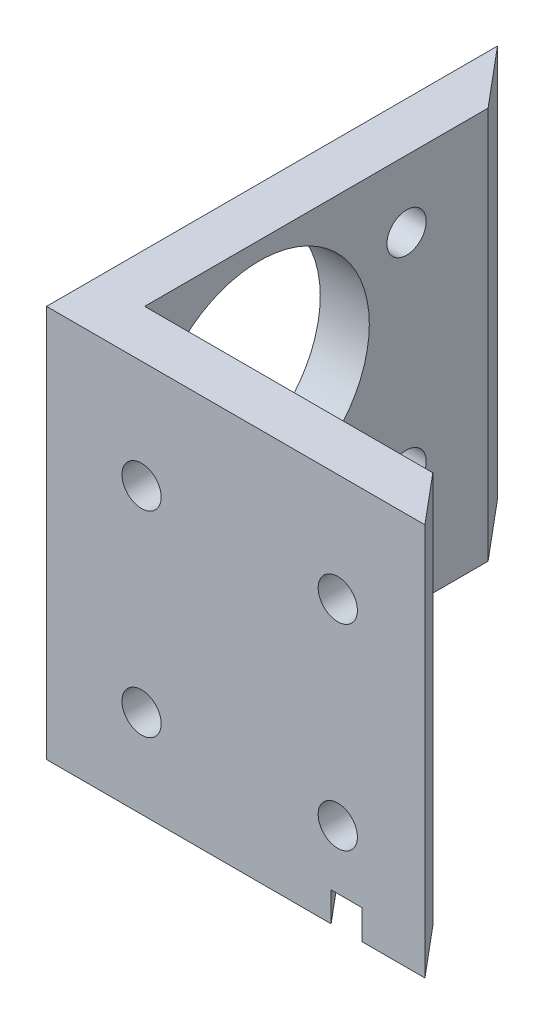
ISO-10303-21;
HEADER;
FILE_DESCRIPTION(('STEP AP214'),'2;1');
FILE_NAME('part.step','',(''),(''),'','','');
FILE_SCHEMA(('AUTOMOTIVE_DESIGN { 1 0 10303 214 1 1 1 1 }'));
ENDSEC;
DATA;
#1=APPLICATION_CONTEXT('core data for automotive mechanical design processes');
#2=APPLICATION_PROTOCOL_DEFINITION('international standard','automotive_design',2000,#1);
#3=PRODUCT_CONTEXT('',#1,'mechanical');
#4=PRODUCT('Part','Part','',(#3));
#5=PRODUCT_RELATED_PRODUCT_CATEGORY('part','',(#4));
#6=PRODUCT_DEFINITION_FORMATION('','',#4);
#7=PRODUCT_DEFINITION_CONTEXT('part definition',#1,'design');
#8=PRODUCT_DEFINITION('design','',#6,#7);
#9=PRODUCT_DEFINITION_SHAPE('','',#8);
#10=(LENGTH_UNIT() NAMED_UNIT(*) SI_UNIT(.MILLI.,.METRE.));
#11=(NAMED_UNIT(*) PLANE_ANGLE_UNIT() SI_UNIT($,.RADIAN.));
#12=(NAMED_UNIT(*) SI_UNIT($,.STERADIAN.) SOLID_ANGLE_UNIT());
#13=UNCERTAINTY_MEASURE_WITH_UNIT(LENGTH_MEASURE(1.E-05),#10,'distance_accuracy_value','');
#14=(GEOMETRIC_REPRESENTATION_CONTEXT(3) GLOBAL_UNCERTAINTY_ASSIGNED_CONTEXT((#13)) GLOBAL_UNIT_ASSIGNED_CONTEXT((#10,
#11,#12)) REPRESENTATION_CONTEXT('',''));
#15=CARTESIAN_POINT('',(0.,0.,0.));
#16=DIRECTION('',(0.,0.,1.));
#17=DIRECTION('',(1.,0.,0.));
#18=AXIS2_PLACEMENT_3D('',#15,#16,#17);
#19=CARTESIAN_POINT('',(0.,0.,0.));
#20=DIRECTION('',(0.,-1.,0.));
#21=DIRECTION('',(0.,0.,-1.));
#22=AXIS2_PLACEMENT_3D('',#19,#20,#21);
#23=PLANE('',#22);
#24=DIRECTION('',(-0.642787609686534,0.,-0.766044443118982));
#25=VECTOR('',#24,1.);
#26=CARTESIAN_POINT('',(36.8381317972101,0.,0.));
#27=LINE('',#26,#25);
#28=CARTESIAN_POINT('',(36.8381317972101,0.,0.));
#29=VERTEX_POINT('',#28);
#30=CARTESIAN_POINT('',(31.5098491392345,0.,-6.35000000000001));
#31=VERTEX_POINT('',#30);
#32=EDGE_CURVE('E150',#29,#31,#27,.T.);
#33=ORIENTED_EDGE('',*,*,#32,.F.);
#34=DIRECTION('',(1.,0.,0.));
#35=VECTOR('',#34,1.);
#36=CARTESIAN_POINT('',(0.,0.,0.));
#37=LINE('',#36,#35);
#38=CARTESIAN_POINT('',(0.,0.,0.));
#39=VERTEX_POINT('',#38);
#40=EDGE_CURVE('E247',#39,#29,#37,.T.);
#41=ORIENTED_EDGE('',*,*,#40,.F.);
#42=DIRECTION('',(0.,0.,1.));
#43=VECTOR('',#42,1.);
#44=CARTESIAN_POINT('',(0.,0.,-58.3725865656664));
#45=LINE('',#44,#43);
#46=CARTESIAN_POINT('',(0.,0.,-43.9019759137848));
#47=VERTEX_POINT('',#46);
#48=EDGE_CURVE('E244',#47,#39,#45,.T.);
#49=ORIENTED_EDGE('',*,*,#48,.F.);
#50=DIRECTION('',(-0.642787609686534,0.,-0.766044443118983));
#51=VECTOR('',#50,1.);
#52=CARTESIAN_POINT('',(21.6175031262252,0.,-18.139238900189));
#53=LINE('',#52,#51);
#54=CARTESIAN_POINT('',(6.34999999999999,0.,-36.3343406008115));
#55=VERTEX_POINT('',#54);
#56=EDGE_CURVE('E41',#55,#47,#53,.T.);
#57=ORIENTED_EDGE('',*,*,#56,.F.);
#58=DIRECTION('',(0.,0.,-1.));
#59=VECTOR('',#58,1.);
#60=CARTESIAN_POINT('',(6.35,0.,-50.8049512526931));
#61=LINE('',#60,#59);
#62=CARTESIAN_POINT('',(6.35000000000001,0.,-6.35));
#63=VERTEX_POINT('',#62);
#64=EDGE_CURVE('E231',#63,#55,#61,.T.);
#65=ORIENTED_EDGE('',*,*,#64,.F.);
#66=DIRECTION('',(-1.,0.,0.));
#67=VECTOR('',#66,1.);
#68=CARTESIAN_POINT('',(6.35000000000001,0.,-6.35));
#69=LINE('',#68,#67);
#70=EDGE_CURVE('E252',#31,#63,#69,.T.);
#71=ORIENTED_EDGE('',*,*,#70,.F.);
#72=EDGE_LOOP('',(#33,#41,#49,#57,#65,#71));
#73=FACE_BOUND('',#72,.T.);
#74=ADVANCED_FACE('F33',(#73),#23,.T.);
#75=DIRECTION('',(0.642787609686534,0.,0.766044443118982));
#76=VECTOR('',#75,1.);
#77=CARTESIAN_POINT('',(0.,0.,-48.6438221380554));
#78=LINE('',#77,#76);
#79=CARTESIAN_POINT('',(0.,0.,-48.6438221380554));
#80=VERTEX_POINT('',#79);
#81=CARTESIAN_POINT('',(6.35000000000001,0.,-41.076186825082));
#82=VERTEX_POINT('',#81);
#83=EDGE_CURVE('E305',#80,#82,#78,.T.);
#84=ORIENTED_EDGE('',*,*,#83,.F.);
#85=CARTESIAN_POINT('',(0.,0.,-58.3725865656664));
#86=VERTEX_POINT('',#85);
#87=EDGE_CURVE('E155',#86,#80,#45,.T.);
#88=ORIENTED_EDGE('',*,*,#87,.F.);
#89=DIRECTION('',(-0.642787609686534,0.,-0.766044443118982));
#90=VECTOR('',#89,1.);
#91=CARTESIAN_POINT('',(6.35,0.,-50.8049512526931));
#92=LINE('',#91,#90);
#93=CARTESIAN_POINT('',(6.35,0.,-50.8049512526931));
#94=VERTEX_POINT('',#93);
#95=EDGE_CURVE('E226',#94,#86,#92,.T.);
#96=ORIENTED_EDGE('',*,*,#95,.F.);
#97=EDGE_CURVE('E256',#82,#94,#61,.T.);
#98=ORIENTED_EDGE('',*,*,#97,.F.);
#99=EDGE_LOOP('',(#84,#88,#96,#98));
#100=FACE_BOUND('',#99,.T.);
#101=ADVANCED_FACE('F304',(#100),#23,.T.);
#102=CARTESIAN_POINT('',(6.35,50.8,-50.8049512526931));
#103=DIRECTION('',(-0.766044443118982,0.,0.642787609686534));
#104=DIRECTION('',(0.642787609686534,0.,0.766044443118982));
#105=AXIS2_PLACEMENT_3D('',#102,#103,#104);
#106=PLANE('',#105);
#107=ORIENTED_EDGE('',*,*,#95,.T.);
#108=DIRECTION('',(0.,-1.,0.));
#109=VECTOR('',#108,1.);
#110=CARTESIAN_POINT('',(0.,50.8,-58.3725865656664));
#111=LINE('',#110,#109);
#112=CARTESIAN_POINT('',(0.,50.8,-58.3725865656664));
#113=VERTEX_POINT('',#112);
#114=EDGE_CURVE('E273',#113,#86,#111,.T.);
#115=ORIENTED_EDGE('',*,*,#114,.F.);
#116=DIRECTION('',(-0.642787609686534,0.,-0.766044443118982));
#117=VECTOR('',#116,1.);
#118=CARTESIAN_POINT('',(6.35,50.8,-50.8049512526931));
#119=LINE('',#118,#117);
#120=CARTESIAN_POINT('',(6.35,50.8,-50.8049512526931));
#121=VERTEX_POINT('',#120);
#122=EDGE_CURVE('E227',#121,#113,#119,.T.);
#123=ORIENTED_EDGE('',*,*,#122,.F.);
#124=DIRECTION('',(0.,-1.,0.));
#125=VECTOR('',#124,1.);
#126=CARTESIAN_POINT('',(6.35,50.8,-50.8049512526931));
#127=LINE('',#126,#125);
#128=EDGE_CURVE('E241',#121,#94,#127,.T.);
#129=ORIENTED_EDGE('',*,*,#128,.T.);
#130=EDGE_LOOP('',(#107,#115,#123,#129));
#131=FACE_BOUND('',#130,.T.);
#132=ADVANCED_FACE('F35',(#131),#106,.F.);
#133=CARTESIAN_POINT('',(0.,50.8,-58.3725865656664));
#134=DIRECTION('',(1.,0.,0.));
#135=DIRECTION('',(0.,0.,-1.));
#136=AXIS2_PLACEMENT_3D('',#133,#134,#135);
#137=PLANE('',#136);
#138=CARTESIAN_POINT('',(0.,42.1259,-40.259));
#139=DIRECTION('',(1.,0.,0.));
#140=DIRECTION('',(0.,0.,-1.));
#141=AXIS2_PLACEMENT_3D('',#138,#139,#140);
#142=CIRCLE('',#141,2.54);
#143=CARTESIAN_POINT('',(0.,42.1259,-42.799));
#144=VERTEX_POINT('',#143);
#145=EDGE_CURVE('E181',#144,#144,#142,.F.);
#146=ORIENTED_EDGE('',*,*,#145,.F.);
#147=EDGE_LOOP('',(#146));
#148=FACE_BOUND('',#147,.T.);
#149=CARTESIAN_POINT('',(0.,15.2019,-40.259));
#150=DIRECTION('',(1.,0.,0.));
#151=DIRECTION('',(0.,0.,-1.));
#152=AXIS2_PLACEMENT_3D('',#149,#150,#151);
#153=CIRCLE('',#152,2.54);
#154=CARTESIAN_POINT('',(0.,15.2019,-42.799));
#155=VERTEX_POINT('',#154);
#156=EDGE_CURVE('E187',#155,#155,#153,.F.);
#157=ORIENTED_EDGE('',*,*,#156,.F.);
#158=EDGE_LOOP('',(#157));
#159=FACE_BOUND('',#158,.T.);
#160=CARTESIAN_POINT('',(0.,15.2019,-13.335));
#161=DIRECTION('',(1.,0.,0.));
#162=DIRECTION('',(0.,0.,-1.));
#163=AXIS2_PLACEMENT_3D('',#160,#161,#162);
#164=CIRCLE('',#163,2.54);
#165=CARTESIAN_POINT('',(0.,15.2019,-15.875));
#166=VERTEX_POINT('',#165);
#167=EDGE_CURVE('E193',#166,#166,#164,.F.);
#168=ORIENTED_EDGE('',*,*,#167,.F.);
#169=EDGE_LOOP('',(#168));
#170=FACE_BOUND('',#169,.T.);
#171=CARTESIAN_POINT('',(0.,34.2519,-21.209));
#172=DIRECTION('',(1.,0.,0.));
#173=DIRECTION('',(0.,0.,-1.));
#174=AXIS2_PLACEMENT_3D('',#171,#172,#173);
#175=CIRCLE('',#174,14.224);
#176=CARTESIAN_POINT('',(0.,34.2519,-35.433));
#177=VERTEX_POINT('',#176);
#178=EDGE_CURVE('E199',#177,#177,#175,.F.);
#179=ORIENTED_EDGE('',*,*,#178,.F.);
#180=EDGE_LOOP('',(#179));
#181=FACE_BOUND('',#180,.T.);
#182=DIRECTION('',(0.,0.,-1.));
#183=VECTOR('',#182,1.);
#184=CARTESIAN_POINT('',(0.,3.81,-43.9019759137848));
#185=LINE('',#184,#183);
#186=CARTESIAN_POINT('',(0.,3.81,-43.9019759137848));
#187=VERTEX_POINT('',#186);
#188=CARTESIAN_POINT('',(0.,3.81,-48.6438221380554));
#189=VERTEX_POINT('',#188);
#190=EDGE_CURVE('E143',#187,#189,#185,.T.);
#191=ORIENTED_EDGE('',*,*,#190,.F.);
#192=DIRECTION('',(0.,-1.,0.));
#193=VECTOR('',#192,1.);
#194=CARTESIAN_POINT('',(0.,3.81,-43.9019759137848));
#195=LINE('',#194,#193);
#196=EDGE_CURVE('E167',#187,#47,#195,.T.);
#197=ORIENTED_EDGE('',*,*,#196,.T.);
#198=ORIENTED_EDGE('',*,*,#48,.T.);
#199=DIRECTION('',(0.,-1.,0.));
#200=VECTOR('',#199,1.);
#201=CARTESIAN_POINT('',(0.,50.8,0.));
#202=LINE('',#201,#200);
#203=CARTESIAN_POINT('',(0.,50.8,0.));
#204=VERTEX_POINT('',#203);
#205=EDGE_CURVE('E270',#204,#39,#202,.T.);
#206=ORIENTED_EDGE('',*,*,#205,.F.);
#207=DIRECTION('',(0.,0.,1.));
#208=VECTOR('',#207,1.);
#209=CARTESIAN_POINT('',(0.,50.8,-58.3725865656664));
#210=LINE('',#209,#208);
#211=EDGE_CURVE('E230',#113,#204,#210,.T.);
#212=ORIENTED_EDGE('',*,*,#211,.F.);
#213=ORIENTED_EDGE('',*,*,#114,.T.);
#214=ORIENTED_EDGE('',*,*,#87,.T.);
#215=DIRECTION('',(0.,-1.,0.));
#216=VECTOR('',#215,1.);
#217=CARTESIAN_POINT('',(0.,3.81,-48.6438221380554));
#218=LINE('',#217,#216);
#219=EDGE_CURVE('E48',#189,#80,#218,.T.);
#220=ORIENTED_EDGE('',*,*,#219,.F.);
#221=EDGE_LOOP('',(#191,#197,#198,#206,#212,#213,#214,#220));
#222=FACE_BOUND('',#221,.T.);
#223=ADVANCED_FACE('F153',(#148,#159,#170,#181,#222),#137,.F.);
#224=CARTESIAN_POINT('',(0.,50.8,0.));
#225=DIRECTION('',(0.,0.,-1.));
#226=DIRECTION('',(-1.,0.,0.));
#227=AXIS2_PLACEMENT_3D('',#224,#225,#226);
#228=PLANE('',#227);
#229=ORIENTED_EDGE('',*,*,#40,.T.);
#230=DIRECTION('',(0.,-1.,0.));
#231=VECTOR('',#230,1.);
#232=CARTESIAN_POINT('',(36.8381317972101,3.81,0.));
#233=LINE('',#232,#231);
#234=CARTESIAN_POINT('',(36.8381317972101,3.81,0.));
#235=VERTEX_POINT('',#234);
#236=EDGE_CURVE('E160',#235,#29,#233,.T.);
#237=ORIENTED_EDGE('',*,*,#236,.F.);
#238=DIRECTION('',(-1.,0.,0.));
#239=VECTOR('',#238,1.);
#240=CARTESIAN_POINT('',(40.8170132150949,3.81,0.));
#241=LINE('',#240,#239);
#242=CARTESIAN_POINT('',(40.8170132150949,3.81,0.));
#243=VERTEX_POINT('',#242);
#244=EDGE_CURVE('E139',#243,#235,#241,.T.);
#245=ORIENTED_EDGE('',*,*,#244,.F.);
#246=DIRECTION('',(0.,-1.,0.));
#247=VECTOR('',#246,1.);
#248=CARTESIAN_POINT('',(40.8170132150949,3.81,0.));
#249=LINE('',#248,#247);
#250=CARTESIAN_POINT('',(40.8170132150949,0.,0.));
#251=VERTEX_POINT('',#250);
#252=EDGE_CURVE('E156',#243,#251,#249,.T.);
#253=ORIENTED_EDGE('',*,*,#252,.T.);
#254=CARTESIAN_POINT('',(48.980415858114,0.,0.));
#255=VERTEX_POINT('',#254);
#256=EDGE_CURVE('E246',#251,#255,#37,.T.);
#257=ORIENTED_EDGE('',*,*,#256,.T.);
#258=DIRECTION('',(0.,-1.,0.));
#259=VECTOR('',#258,1.);
#260=CARTESIAN_POINT('',(48.980415858114,50.8,0.));
#261=LINE('',#260,#259);
#262=CARTESIAN_POINT('',(48.980415858114,50.8,0.));
#263=VERTEX_POINT('',#262);
#264=EDGE_CURVE('E267',#263,#255,#261,.T.);
#265=ORIENTED_EDGE('',*,*,#264,.F.);
#266=DIRECTION('',(1.,0.,0.));
#267=VECTOR('',#266,1.);
#268=CARTESIAN_POINT('',(0.,50.8,0.));
#269=LINE('',#268,#267);
#270=EDGE_CURVE('E233',#204,#263,#269,.T.);
#271=ORIENTED_EDGE('',*,*,#270,.F.);
#272=ORIENTED_EDGE('',*,*,#205,.T.);
#273=EDGE_LOOP('',(#229,#237,#245,#253,#257,#265,#271,#272));
#274=FACE_BOUND('',#273,.T.);
#275=CARTESIAN_POINT('',(12.3010666000691,11.43,0.));
#276=DIRECTION('',(0.,0.,-1.));
#277=DIRECTION('',(-1.,0.,0.));
#278=AXIS2_PLACEMENT_3D('',#275,#276,#277);
#279=CIRCLE('',#278,2.54);
#280=CARTESIAN_POINT('',(9.76106660006914,11.43,0.));
#281=VERTEX_POINT('',#280);
#282=EDGE_CURVE('E205',#281,#281,#279,.F.);
#283=ORIENTED_EDGE('',*,*,#282,.F.);
#284=EDGE_LOOP('',(#283));
#285=FACE_BOUND('',#284,.T.);
#286=CARTESIAN_POINT('',(37.7010666000691,11.43,0.));
#287=DIRECTION('',(0.,0.,-1.));
#288=DIRECTION('',(-1.,0.,0.));
#289=AXIS2_PLACEMENT_3D('',#286,#287,#288);
#290=CIRCLE('',#289,2.54);
#291=CARTESIAN_POINT('',(35.1610666000691,11.43,0.));
#292=VERTEX_POINT('',#291);
#293=EDGE_CURVE('E211',#292,#292,#290,.F.);
#294=ORIENTED_EDGE('',*,*,#293,.F.);
#295=EDGE_LOOP('',(#294));
#296=FACE_BOUND('',#295,.T.);
#297=CARTESIAN_POINT('',(12.3010666000691,36.83,0.));
#298=DIRECTION('',(0.,0.,-1.));
#299=DIRECTION('',(-1.,0.,0.));
#300=AXIS2_PLACEMENT_3D('',#297,#298,#299);
#301=CIRCLE('',#300,2.54);
#302=CARTESIAN_POINT('',(9.76106660006914,36.83,0.));
#303=VERTEX_POINT('',#302);
#304=EDGE_CURVE('E217',#303,#303,#301,.F.);
#305=ORIENTED_EDGE('',*,*,#304,.F.);
#306=EDGE_LOOP('',(#305));
#307=FACE_BOUND('',#306,.T.);
#308=CARTESIAN_POINT('',(37.7010666000691,36.83,0.));
#309=DIRECTION('',(0.,0.,-1.));
#310=DIRECTION('',(-1.,0.,0.));
#311=AXIS2_PLACEMENT_3D('',#308,#309,#310);
#312=CIRCLE('',#311,2.54);
#313=CARTESIAN_POINT('',(35.1610666000691,36.83,0.));
#314=VERTEX_POINT('',#313);
#315=EDGE_CURVE('E223',#314,#314,#312,.F.);
#316=ORIENTED_EDGE('',*,*,#315,.F.);
#317=EDGE_LOOP('',(#316));
#318=FACE_BOUND('',#317,.T.);
#319=ADVANCED_FACE('F289',(#274,#285,#296,#307,#318),#228,.F.);
#320=CARTESIAN_POINT('',(48.980415858114,50.8,0.));
#321=DIRECTION('',(-0.766044443118981,0.,0.642787609686535));
#322=DIRECTION('',(0.642787609686535,0.,0.766044443118981));
#323=AXIS2_PLACEMENT_3D('',#320,#321,#322);
#324=PLANE('',#323);
#325=DIRECTION('',(-0.642787609686535,0.,-0.766044443118981));
#326=VECTOR('',#325,1.);
#327=CARTESIAN_POINT('',(48.980415858114,0.,0.));
#328=LINE('',#327,#326);
#329=CARTESIAN_POINT('',(43.6521332001383,0.,-6.35));
#330=VERTEX_POINT('',#329);
#331=EDGE_CURVE('E250',#255,#330,#328,.T.);
#332=ORIENTED_EDGE('',*,*,#331,.T.);
#333=DIRECTION('',(0.,-1.,0.));
#334=VECTOR('',#333,1.);
#335=CARTESIAN_POINT('',(43.6521332001383,50.8,-6.35));
#336=LINE('',#335,#334);
#337=CARTESIAN_POINT('',(43.6521332001383,50.8,-6.35));
#338=VERTEX_POINT('',#337);
#339=EDGE_CURVE('E264',#338,#330,#336,.T.);
#340=ORIENTED_EDGE('',*,*,#339,.F.);
#341=DIRECTION('',(-0.642787609686535,0.,-0.766044443118981));
#342=VECTOR('',#341,1.);
#343=CARTESIAN_POINT('',(48.980415858114,50.8,0.));
#344=LINE('',#343,#342);
#345=EDGE_CURVE('E235',#263,#338,#344,.T.);
#346=ORIENTED_EDGE('',*,*,#345,.F.);
#347=ORIENTED_EDGE('',*,*,#264,.T.);
#348=EDGE_LOOP('',(#332,#340,#346,#347));
#349=FACE_BOUND('',#348,.T.);
#350=ADVANCED_FACE('F327',(#349),#324,.F.);
#351=CARTESIAN_POINT('',(6.35000000000001,50.8,-6.35));
#352=DIRECTION('',(0.,0.,1.));
#353=DIRECTION('',(1.,0.,0.));
#354=AXIS2_PLACEMENT_3D('',#351,#352,#353);
#355=PLANE('',#354);
#356=CARTESIAN_POINT('',(12.3010666000691,11.43,-6.35));
#357=DIRECTION('',(0.,0.,-1.));
#358=DIRECTION('',(-1.,0.,0.));
#359=AXIS2_PLACEMENT_3D('',#356,#357,#358);
#360=CIRCLE('',#359,2.54);
#361=CARTESIAN_POINT('',(9.76106660006914,11.43,-6.35));
#362=VERTEX_POINT('',#361);
#363=EDGE_CURVE('E202',#362,#362,#360,.T.);
#364=ORIENTED_EDGE('',*,*,#363,.F.);
#365=EDGE_LOOP('',(#364));
#366=FACE_BOUND('',#365,.T.);
#367=CARTESIAN_POINT('',(37.7010666000691,11.43,-6.35));
#368=DIRECTION('',(0.,0.,-1.));
#369=DIRECTION('',(-1.,0.,0.));
#370=AXIS2_PLACEMENT_3D('',#367,#368,#369);
#371=CIRCLE('',#370,2.54);
#372=CARTESIAN_POINT('',(35.1610666000691,11.43,-6.35));
#373=VERTEX_POINT('',#372);
#374=EDGE_CURVE('E208',#373,#373,#371,.T.);
#375=ORIENTED_EDGE('',*,*,#374,.F.);
#376=EDGE_LOOP('',(#375));
#377=FACE_BOUND('',#376,.T.);
#378=CARTESIAN_POINT('',(12.3010666000691,36.83,-6.35));
#379=DIRECTION('',(0.,0.,-1.));
#380=DIRECTION('',(-1.,0.,0.));
#381=AXIS2_PLACEMENT_3D('',#378,#379,#380);
#382=CIRCLE('',#381,2.54);
#383=CARTESIAN_POINT('',(9.76106660006914,36.83,-6.35));
#384=VERTEX_POINT('',#383);
#385=EDGE_CURVE('E214',#384,#384,#382,.T.);
#386=ORIENTED_EDGE('',*,*,#385,.F.);
#387=EDGE_LOOP('',(#386));
#388=FACE_BOUND('',#387,.T.);
#389=CARTESIAN_POINT('',(37.7010666000691,36.83,-6.35));
#390=DIRECTION('',(0.,0.,-1.));
#391=DIRECTION('',(-1.,0.,0.));
#392=AXIS2_PLACEMENT_3D('',#389,#390,#391);
#393=CIRCLE('',#392,2.54);
#394=CARTESIAN_POINT('',(35.1610666000691,36.83,-6.35));
#395=VERTEX_POINT('',#394);
#396=EDGE_CURVE('E220',#395,#395,#393,.T.);
#397=ORIENTED_EDGE('',*,*,#396,.F.);
#398=EDGE_LOOP('',(#397));
#399=FACE_BOUND('',#398,.T.);
#400=DIRECTION('',(-1.,0.,0.));
#401=VECTOR('',#400,1.);
#402=CARTESIAN_POINT('',(6.35000000000001,3.81,-6.35));
#403=LINE('',#402,#401);
#404=CARTESIAN_POINT('',(35.4887305571193,3.81,-6.35));
#405=VERTEX_POINT('',#404);
#406=CARTESIAN_POINT('',(31.5098491392345,3.81,-6.35));
#407=VERTEX_POINT('',#406);
#408=EDGE_CURVE('E175',#405,#407,#403,.T.);
#409=ORIENTED_EDGE('',*,*,#408,.T.);
#410=DIRECTION('',(0.,-1.,0.));
#411=VECTOR('',#410,1.);
#412=CARTESIAN_POINT('',(31.5098491392345,50.8,-6.35));
#413=LINE('',#412,#411);
#414=EDGE_CURVE('E172',#407,#31,#413,.T.);
#415=ORIENTED_EDGE('',*,*,#414,.T.);
#416=ORIENTED_EDGE('',*,*,#70,.T.);
#417=DIRECTION('',(0.,-1.,0.));
#418=VECTOR('',#417,1.);
#419=CARTESIAN_POINT('',(6.35000000000001,50.8,-6.35));
#420=LINE('',#419,#418);
#421=CARTESIAN_POINT('',(6.35000000000001,50.8,-6.35));
#422=VERTEX_POINT('',#421);
#423=EDGE_CURVE('E261',#422,#63,#420,.T.);
#424=ORIENTED_EDGE('',*,*,#423,.F.);
#425=DIRECTION('',(-1.,0.,0.));
#426=VECTOR('',#425,1.);
#427=CARTESIAN_POINT('',(6.35000000000001,50.8,-6.35));
#428=LINE('',#427,#426);
#429=EDGE_CURVE('E237',#338,#422,#428,.T.);
#430=ORIENTED_EDGE('',*,*,#429,.F.);
#431=ORIENTED_EDGE('',*,*,#339,.T.);
#432=CARTESIAN_POINT('',(35.4887305571193,0.,-6.35));
#433=VERTEX_POINT('',#432);
#434=EDGE_CURVE('E253',#330,#433,#69,.T.);
#435=ORIENTED_EDGE('',*,*,#434,.T.);
#436=DIRECTION('',(0.,1.,0.));
#437=VECTOR('',#436,1.);
#438=CARTESIAN_POINT('',(35.4887305571193,50.8,-6.35));
#439=LINE('',#438,#437);
#440=EDGE_CURVE('E56',#433,#405,#439,.T.);
#441=ORIENTED_EDGE('',*,*,#440,.T.);
#442=EDGE_LOOP('',(#409,#415,#416,#424,#430,#431,#435,#441));
#443=FACE_BOUND('',#442,.T.);
#444=ADVANCED_FACE('F315',(#366,#377,#388,#399,#443),#355,.F.);
#445=CARTESIAN_POINT('',(6.35,50.8,-50.8049512526931));
#446=DIRECTION('',(-1.,0.,0.));
#447=DIRECTION('',(0.,0.,1.));
#448=AXIS2_PLACEMENT_3D('',#445,#446,#447);
#449=PLANE('',#448);
#450=ORIENTED_EDGE('',*,*,#64,.T.);
#451=DIRECTION('',(0.,1.,0.));
#452=VECTOR('',#451,1.);
#453=CARTESIAN_POINT('',(6.35,50.8,-36.3343406008115));
#454=LINE('',#453,#452);
#455=CARTESIAN_POINT('',(6.35000000000001,3.81,-36.3343406008114));
#456=VERTEX_POINT('',#455);
#457=EDGE_CURVE('E169',#55,#456,#454,.T.);
#458=ORIENTED_EDGE('',*,*,#457,.T.);
#459=DIRECTION('',(0.,0.,-1.));
#460=VECTOR('',#459,1.);
#461=CARTESIAN_POINT('',(6.35,3.81,-50.8049512526931));
#462=LINE('',#461,#460);
#463=CARTESIAN_POINT('',(6.35,3.81,-41.076186825082));
#464=VERTEX_POINT('',#463);
#465=EDGE_CURVE('E11',#456,#464,#462,.T.);
#466=ORIENTED_EDGE('',*,*,#465,.T.);
#467=DIRECTION('',(0.,-1.,0.));
#468=VECTOR('',#467,1.);
#469=CARTESIAN_POINT('',(6.35,50.8,-41.076186825082));
#470=LINE('',#469,#468);
#471=EDGE_CURVE('E137',#464,#82,#470,.T.);
#472=ORIENTED_EDGE('',*,*,#471,.T.);
#473=ORIENTED_EDGE('',*,*,#97,.T.);
#474=ORIENTED_EDGE('',*,*,#128,.F.);
#475=DIRECTION('',(0.,0.,-1.));
#476=VECTOR('',#475,1.);
#477=CARTESIAN_POINT('',(6.35,50.8,-50.8049512526931));
#478=LINE('',#477,#476);
#479=EDGE_CURVE('E239',#422,#121,#478,.T.);
#480=ORIENTED_EDGE('',*,*,#479,.F.);
#481=ORIENTED_EDGE('',*,*,#423,.T.);
#482=EDGE_LOOP('',(#450,#458,#466,#472,#473,#474,#480,#481));
#483=FACE_BOUND('',#482,.T.);
#484=CARTESIAN_POINT('',(6.35,42.1259,-40.259));
#485=DIRECTION('',(1.,0.,0.));
#486=DIRECTION('',(0.,0.,-1.));
#487=AXIS2_PLACEMENT_3D('',#484,#485,#486);
#488=CIRCLE('',#487,2.54);
#489=CARTESIAN_POINT('',(6.35,42.1259,-42.799));
#490=VERTEX_POINT('',#489);
#491=EDGE_CURVE('E178',#490,#490,#488,.T.);
#492=ORIENTED_EDGE('',*,*,#491,.F.);
#493=EDGE_LOOP('',(#492));
#494=FACE_BOUND('',#493,.T.);
#495=CARTESIAN_POINT('',(6.35,15.2019,-40.259));
#496=DIRECTION('',(1.,0.,0.));
#497=DIRECTION('',(0.,0.,-1.));
#498=AXIS2_PLACEMENT_3D('',#495,#496,#497);
#499=CIRCLE('',#498,2.54);
#500=CARTESIAN_POINT('',(6.35,15.2019,-42.799));
#501=VERTEX_POINT('',#500);
#502=EDGE_CURVE('E184',#501,#501,#499,.T.);
#503=ORIENTED_EDGE('',*,*,#502,.F.);
#504=EDGE_LOOP('',(#503));
#505=FACE_BOUND('',#504,.T.);
#506=CARTESIAN_POINT('',(6.35000000000001,15.2019,-13.335));
#507=DIRECTION('',(1.,0.,0.));
#508=DIRECTION('',(0.,0.,-1.));
#509=AXIS2_PLACEMENT_3D('',#506,#507,#508);
#510=CIRCLE('',#509,2.54);
#511=CARTESIAN_POINT('',(6.35000000000001,15.2019,-15.875));
#512=VERTEX_POINT('',#511);
#513=EDGE_CURVE('E190',#512,#512,#510,.T.);
#514=ORIENTED_EDGE('',*,*,#513,.F.);
#515=EDGE_LOOP('',(#514));
#516=FACE_BOUND('',#515,.T.);
#517=CARTESIAN_POINT('',(6.35000000000001,34.2519,-21.209));
#518=DIRECTION('',(1.,0.,0.));
#519=DIRECTION('',(0.,0.,-1.));
#520=AXIS2_PLACEMENT_3D('',#517,#518,#519);
#521=CIRCLE('',#520,14.224);
#522=CARTESIAN_POINT('',(6.35,34.2519,-35.433));
#523=VERTEX_POINT('',#522);
#524=EDGE_CURVE('E196',#523,#523,#521,.T.);
#525=ORIENTED_EDGE('',*,*,#524,.F.);
#526=EDGE_LOOP('',(#525));
#527=FACE_BOUND('',#526,.T.);
#528=ADVANCED_FACE('F330',(#483,#494,#505,#516,#527),#449,.F.);
#529=CARTESIAN_POINT('',(0.,50.8,0.));
#530=DIRECTION('',(0.,-1.,0.));
#531=DIRECTION('',(0.,0.,-1.));
#532=AXIS2_PLACEMENT_3D('',#529,#530,#531);
#533=PLANE('',#532);
#534=ORIENTED_EDGE('',*,*,#122,.T.);
#535=ORIENTED_EDGE('',*,*,#211,.T.);
#536=ORIENTED_EDGE('',*,*,#270,.T.);
#537=ORIENTED_EDGE('',*,*,#345,.T.);
#538=ORIENTED_EDGE('',*,*,#429,.T.);
#539=ORIENTED_EDGE('',*,*,#479,.T.);
#540=EDGE_LOOP('',(#534,#535,#536,#537,#538,#539));
#541=FACE_BOUND('',#540,.T.);
#542=ADVANCED_FACE('F297',(#541),#533,.F.);
#543=DIRECTION('',(0.642787609686534,0.,0.766044443118982));
#544=VECTOR('',#543,1.);
#545=CARTESIAN_POINT('',(23.9524065888519,0.,-20.0984555345136));
#546=LINE('',#545,#544);
#547=EDGE_CURVE('E275',#433,#251,#546,.T.);
#548=ORIENTED_EDGE('',*,*,#547,.F.);
#549=ORIENTED_EDGE('',*,*,#434,.F.);
#550=ORIENTED_EDGE('',*,*,#331,.F.);
#551=ORIENTED_EDGE('',*,*,#256,.F.);
#552=EDGE_LOOP('',(#548,#549,#550,#551));
#553=FACE_BOUND('',#552,.T.);
#554=ADVANCED_FACE('F321',(#553),#23,.T.);
#555=CARTESIAN_POINT('',(37.7010666000691,36.83,0.00100000000000013));
#556=DIRECTION('',(0.,0.,-1.));
#557=DIRECTION('',(-1.,0.,0.));
#558=AXIS2_PLACEMENT_3D('',#555,#556,#557);
#559=CYLINDRICAL_SURFACE('',#558,2.54);
#560=ORIENTED_EDGE('',*,*,#396,.T.);
#561=EDGE_LOOP('',(#560));
#562=FACE_BOUND('',#561,.T.);
#563=ORIENTED_EDGE('',*,*,#315,.T.);
#564=EDGE_LOOP('',(#563));
#565=FACE_BOUND('',#564,.T.);
#566=ADVANCED_FACE('F366',(#562,#565),#559,.F.);
#567=CARTESIAN_POINT('',(12.3010666000691,36.83,0.00100000000000013));
#568=DIRECTION('',(0.,0.,-1.));
#569=DIRECTION('',(-1.,0.,0.));
#570=AXIS2_PLACEMENT_3D('',#567,#568,#569);
#571=CYLINDRICAL_SURFACE('',#570,2.54);
#572=ORIENTED_EDGE('',*,*,#385,.T.);
#573=EDGE_LOOP('',(#572));
#574=FACE_BOUND('',#573,.T.);
#575=ORIENTED_EDGE('',*,*,#304,.T.);
#576=EDGE_LOOP('',(#575));
#577=FACE_BOUND('',#576,.T.);
#578=ADVANCED_FACE('F371',(#574,#577),#571,.F.);
#579=CARTESIAN_POINT('',(37.7010666000691,11.43,0.00100000000000013));
#580=DIRECTION('',(0.,0.,-1.));
#581=DIRECTION('',(-1.,0.,0.));
#582=AXIS2_PLACEMENT_3D('',#579,#580,#581);
#583=CYLINDRICAL_SURFACE('',#582,2.54);
#584=ORIENTED_EDGE('',*,*,#374,.T.);
#585=EDGE_LOOP('',(#584));
#586=FACE_BOUND('',#585,.T.);
#587=ORIENTED_EDGE('',*,*,#293,.T.);
#588=EDGE_LOOP('',(#587));
#589=FACE_BOUND('',#588,.T.);
#590=ADVANCED_FACE('F379',(#586,#589),#583,.F.);
#591=CARTESIAN_POINT('',(12.3010666000691,11.43,0.00100000000000013));
#592=DIRECTION('',(0.,0.,-1.));
#593=DIRECTION('',(-1.,0.,0.));
#594=AXIS2_PLACEMENT_3D('',#591,#592,#593);
#595=CYLINDRICAL_SURFACE('',#594,2.54);
#596=ORIENTED_EDGE('',*,*,#363,.T.);
#597=EDGE_LOOP('',(#596));
#598=FACE_BOUND('',#597,.T.);
#599=ORIENTED_EDGE('',*,*,#282,.T.);
#600=EDGE_LOOP('',(#599));
#601=FACE_BOUND('',#600,.T.);
#602=ADVANCED_FACE('F346',(#598,#601),#595,.F.);
#603=CARTESIAN_POINT('',(-0.00100000000000794,34.2519,-21.209));
#604=DIRECTION('',(1.,0.,0.));
#605=DIRECTION('',(0.,0.,-1.));
#606=AXIS2_PLACEMENT_3D('',#603,#604,#605);
#607=CYLINDRICAL_SURFACE('',#606,14.224);
#608=ORIENTED_EDGE('',*,*,#524,.T.);
#609=EDGE_LOOP('',(#608));
#610=FACE_BOUND('',#609,.T.);
#611=ORIENTED_EDGE('',*,*,#178,.T.);
#612=EDGE_LOOP('',(#611));
#613=FACE_BOUND('',#612,.T.);
#614=ADVANCED_FACE('F342',(#610,#613),#607,.F.);
#615=CARTESIAN_POINT('',(-0.00100000000000707,15.2019,-13.335));
#616=DIRECTION('',(1.,0.,0.));
#617=DIRECTION('',(0.,0.,-1.));
#618=AXIS2_PLACEMENT_3D('',#615,#616,#617);
#619=CYLINDRICAL_SURFACE('',#618,2.54);
#620=ORIENTED_EDGE('',*,*,#513,.T.);
#621=EDGE_LOOP('',(#620));
#622=FACE_BOUND('',#621,.T.);
#623=ORIENTED_EDGE('',*,*,#167,.T.);
#624=EDGE_LOOP('',(#623));
#625=FACE_BOUND('',#624,.T.);
#626=ADVANCED_FACE('F345',(#622,#625),#619,.F.);
#627=CARTESIAN_POINT('',(-0.00100000000000967,15.2019,-40.259));
#628=DIRECTION('',(1.,0.,0.));
#629=DIRECTION('',(0.,0.,-1.));
#630=AXIS2_PLACEMENT_3D('',#627,#628,#629);
#631=CYLINDRICAL_SURFACE('',#630,2.54);
#632=ORIENTED_EDGE('',*,*,#502,.T.);
#633=EDGE_LOOP('',(#632));
#634=FACE_BOUND('',#633,.T.);
#635=ORIENTED_EDGE('',*,*,#156,.T.);
#636=EDGE_LOOP('',(#635));
#637=FACE_BOUND('',#636,.T.);
#638=ADVANCED_FACE('F389',(#634,#637),#631,.F.);
#639=CARTESIAN_POINT('',(-0.00100000000000967,42.1259,-40.259));
#640=DIRECTION('',(1.,0.,0.));
#641=DIRECTION('',(0.,0.,-1.));
#642=AXIS2_PLACEMENT_3D('',#639,#640,#641);
#643=CYLINDRICAL_SURFACE('',#642,2.54);
#644=ORIENTED_EDGE('',*,*,#491,.T.);
#645=EDGE_LOOP('',(#644));
#646=FACE_BOUND('',#645,.T.);
#647=ORIENTED_EDGE('',*,*,#145,.T.);
#648=EDGE_LOOP('',(#647));
#649=FACE_BOUND('',#648,.T.);
#650=ADVANCED_FACE('F393',(#646,#649),#643,.F.);
#651=CARTESIAN_POINT('',(36.8381317972101,3.81,0.));
#652=DIRECTION('',(-0.766044443118982,0.,0.642787609686534));
#653=DIRECTION('',(0.642787609686534,0.,0.766044443118983));
#654=AXIS2_PLACEMENT_3D('',#651,#652,#653);
#655=PLANE('',#654);
#656=DIRECTION('',(-0.642787609686534,0.,-0.766044443118982));
#657=VECTOR('',#656,1.);
#658=CARTESIAN_POINT('',(36.8381317972101,3.81,0.));
#659=LINE('',#658,#657);
#660=EDGE_CURVE('E157',#235,#407,#659,.T.);
#661=ORIENTED_EDGE('',*,*,#660,.F.);
#662=ORIENTED_EDGE('',*,*,#236,.T.);
#663=ORIENTED_EDGE('',*,*,#32,.T.);
#664=ORIENTED_EDGE('',*,*,#414,.F.);
#665=EDGE_LOOP('',(#661,#662,#663,#664));
#666=FACE_BOUND('',#665,.T.);
#667=ADVANCED_FACE('F311',(#666),#655,.F.);
#668=CARTESIAN_POINT('',(0.,3.81,-48.6438221380554));
#669=DIRECTION('',(0.766044443118982,0.,-0.642787609686534));
#670=DIRECTION('',(-0.642787609686534,0.,-0.766044443118982));
#671=AXIS2_PLACEMENT_3D('',#668,#669,#670);
#672=PLANE('',#671);
#673=ORIENTED_EDGE('',*,*,#547,.T.);
#674=ORIENTED_EDGE('',*,*,#252,.F.);
#675=DIRECTION('',(0.642787609686534,0.,0.766044443118982));
#676=VECTOR('',#675,1.);
#677=CARTESIAN_POINT('',(0.,3.81,-48.6438221380554));
#678=LINE('',#677,#676);
#679=EDGE_CURVE('E140',#405,#243,#678,.T.);
#680=ORIENTED_EDGE('',*,*,#679,.F.);
#681=ORIENTED_EDGE('',*,*,#440,.F.);
#682=EDGE_LOOP('',(#673,#674,#680,#681));
#683=FACE_BOUND('',#682,.T.);
#684=ADVANCED_FACE('F324',(#683),#672,.F.);
#685=CARTESIAN_POINT('',(0.,3.81,0.));
#686=DIRECTION('',(0.,1.,0.));
#687=DIRECTION('',(0.,0.,1.));
#688=AXIS2_PLACEMENT_3D('',#685,#686,#687);
#689=PLANE('',#688);
#690=ORIENTED_EDGE('',*,*,#679,.T.);
#691=ORIENTED_EDGE('',*,*,#244,.T.);
#692=ORIENTED_EDGE('',*,*,#660,.T.);
#693=ORIENTED_EDGE('',*,*,#408,.F.);
#694=EDGE_LOOP('',(#690,#691,#692,#693));
#695=FACE_BOUND('',#694,.T.);
#696=ADVANCED_FACE('F313',(#695),#689,.F.);
#697=EDGE_CURVE('E146',#456,#187,#659,.T.);
#698=ORIENTED_EDGE('',*,*,#697,.T.);
#699=ORIENTED_EDGE('',*,*,#190,.T.);
#700=EDGE_CURVE('E133',#189,#464,#678,.T.);
#701=ORIENTED_EDGE('',*,*,#700,.T.);
#702=ORIENTED_EDGE('',*,*,#465,.F.);
#703=EDGE_LOOP('',(#698,#699,#701,#702));
#704=FACE_BOUND('',#703,.T.);
#705=ADVANCED_FACE('F144',(#704),#689,.F.);
#706=ORIENTED_EDGE('',*,*,#56,.T.);
#707=ORIENTED_EDGE('',*,*,#196,.F.);
#708=ORIENTED_EDGE('',*,*,#697,.F.);
#709=ORIENTED_EDGE('',*,*,#457,.F.);
#710=EDGE_LOOP('',(#706,#707,#708,#709));
#711=FACE_BOUND('',#710,.T.);
#712=ADVANCED_FACE('F278',(#711),#655,.F.);
#713=ORIENTED_EDGE('',*,*,#700,.F.);
#714=ORIENTED_EDGE('',*,*,#219,.T.);
#715=ORIENTED_EDGE('',*,*,#83,.T.);
#716=ORIENTED_EDGE('',*,*,#471,.F.);
#717=EDGE_LOOP('',(#713,#714,#715,#716));
#718=FACE_BOUND('',#717,.T.);
#719=ADVANCED_FACE('F135',(#718),#672,.F.);
#720=CLOSED_SHELL('',(#74,#101,#132,#223,#319,#350,#444,#528,#542,#554,#566,#578,#590,#602,#614,
#626,#638,#650,#667,#684,#696,#705,#712,#719));
#721=MANIFOLD_SOLID_BREP('B2',#720);
#722=ADVANCED_BREP_SHAPE_REPRESENTATION('',(#18,#721),#14);
#723=SHAPE_DEFINITION_REPRESENTATION(#9,#722);
ENDSEC;
END-ISO-10303-21;
